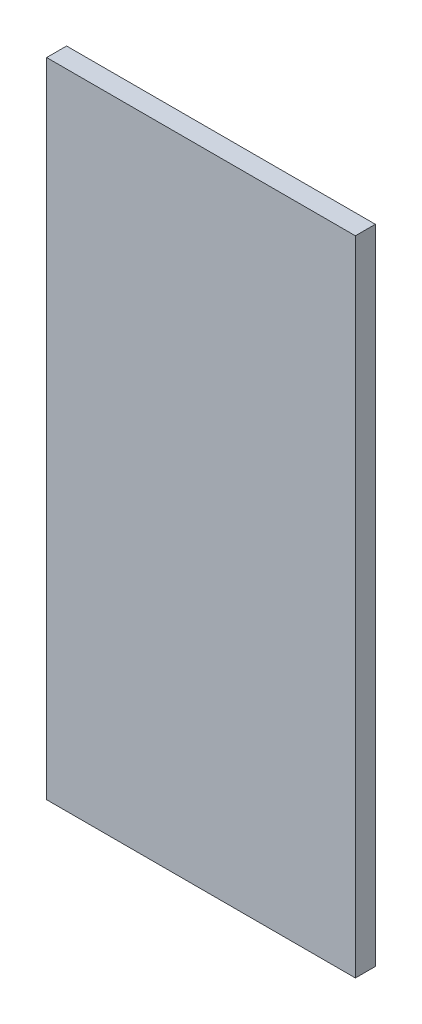
ISO-10303-21;
HEADER;
FILE_DESCRIPTION(('STEP AP214'),'2;1');
FILE_NAME('part.step','',(''),(''),'','','');
FILE_SCHEMA(('AUTOMOTIVE_DESIGN { 1 0 10303 214 1 1 1 1 }'));
ENDSEC;
DATA;
#1=APPLICATION_CONTEXT('core data for automotive mechanical design processes');
#2=APPLICATION_PROTOCOL_DEFINITION('international standard','automotive_design',2000,#1);
#3=PRODUCT_CONTEXT('',#1,'mechanical');
#4=PRODUCT('Part','Part','',(#3));
#5=PRODUCT_RELATED_PRODUCT_CATEGORY('part','',(#4));
#6=PRODUCT_DEFINITION_FORMATION('','',#4);
#7=PRODUCT_DEFINITION_CONTEXT('part definition',#1,'design');
#8=PRODUCT_DEFINITION('design','',#6,#7);
#9=PRODUCT_DEFINITION_SHAPE('','',#8);
#10=(LENGTH_UNIT() NAMED_UNIT(*) SI_UNIT(.MILLI.,.METRE.));
#11=(NAMED_UNIT(*) PLANE_ANGLE_UNIT() SI_UNIT($,.RADIAN.));
#12=(NAMED_UNIT(*) SI_UNIT($,.STERADIAN.) SOLID_ANGLE_UNIT());
#13=UNCERTAINTY_MEASURE_WITH_UNIT(LENGTH_MEASURE(1.E-05),#10,'distance_accuracy_value','');
#14=(GEOMETRIC_REPRESENTATION_CONTEXT(3) GLOBAL_UNCERTAINTY_ASSIGNED_CONTEXT((#13)) GLOBAL_UNIT_ASSIGNED_CONTEXT((#10,
#11,#12)) REPRESENTATION_CONTEXT('',''));
#15=CARTESIAN_POINT('',(0.,0.,0.));
#16=DIRECTION('',(0.,0.,1.));
#17=DIRECTION('',(1.,0.,0.));
#18=AXIS2_PLACEMENT_3D('',#15,#16,#17);
#19=CARTESIAN_POINT('',(87.8420028686523,102.857002258301,0.));
#20=DIRECTION('',(1.,0.,0.));
#21=DIRECTION('',(0.,-1.,0.));
#22=AXIS2_PLACEMENT_3D('',#19,#20,#21);
#23=PLANE('',#22);
#24=DIRECTION('',(0.,-1.,0.));
#25=VECTOR('',#24,1.);
#26=CARTESIAN_POINT('',(87.8420028686523,102.857002258301,0.03556));
#27=LINE('',#26,#25);
#28=CARTESIAN_POINT('',(87.8420028686523,102.857002258301,0.03556));
#29=VERTEX_POINT('',#28);
#30=CARTESIAN_POINT('',(87.8420028686523,101.71199798584,0.03556));
#31=VERTEX_POINT('',#30);
#32=EDGE_CURVE('E11',#29,#31,#27,.T.);
#33=ORIENTED_EDGE('',*,*,#32,.F.);
#34=DIRECTION('',(0.,0.,1.));
#35=VECTOR('',#34,1.);
#36=CARTESIAN_POINT('',(87.8420028686523,102.857002258301,0.));
#37=LINE('',#36,#35);
#38=CARTESIAN_POINT('',(87.8420028686523,102.857002258301,0.));
#39=VERTEX_POINT('',#38);
#40=EDGE_CURVE('E24',#39,#29,#37,.T.);
#41=ORIENTED_EDGE('',*,*,#40,.F.);
#42=DIRECTION('',(0.,-1.,0.));
#43=VECTOR('',#42,1.);
#44=CARTESIAN_POINT('',(87.8420028686523,102.857002258301,0.));
#45=LINE('',#44,#43);
#46=CARTESIAN_POINT('',(87.8420028686523,101.71199798584,0.));
#47=VERTEX_POINT('',#46);
#48=EDGE_CURVE('E75',#39,#47,#45,.T.);
#49=ORIENTED_EDGE('',*,*,#48,.T.);
#50=DIRECTION('',(0.,0.,1.));
#51=VECTOR('',#50,1.);
#52=CARTESIAN_POINT('',(87.8420028686523,101.71199798584,0.));
#53=LINE('',#52,#51);
#54=EDGE_CURVE('E37',#47,#31,#53,.T.);
#55=ORIENTED_EDGE('',*,*,#54,.T.);
#56=EDGE_LOOP('',(#33,#41,#49,#55));
#57=FACE_BOUND('',#56,.T.);
#58=ADVANCED_FACE('F17',(#57),#23,.F.);
#59=CARTESIAN_POINT('',(87.8420028686523,101.71199798584,0.));
#60=DIRECTION('',(0.,1.,0.));
#61=DIRECTION('',(1.,0.,0.));
#62=AXIS2_PLACEMENT_3D('',#59,#60,#61);
#63=PLANE('',#62);
#64=DIRECTION('',(1.,0.,0.));
#65=VECTOR('',#64,1.);
#66=CARTESIAN_POINT('',(87.8420028686523,101.71199798584,0.03556));
#67=LINE('',#66,#65);
#68=CARTESIAN_POINT('',(88.3919982910156,101.71199798584,0.03556));
#69=VERTEX_POINT('',#68);
#70=EDGE_CURVE('E83',#31,#69,#67,.T.);
#71=ORIENTED_EDGE('',*,*,#70,.F.);
#72=ORIENTED_EDGE('',*,*,#54,.F.);
#73=DIRECTION('',(1.,0.,0.));
#74=VECTOR('',#73,1.);
#75=CARTESIAN_POINT('',(87.8420028686523,101.71199798584,0.));
#76=LINE('',#75,#74);
#77=CARTESIAN_POINT('',(88.3919982910156,101.71199798584,0.));
#78=VERTEX_POINT('',#77);
#79=EDGE_CURVE('E81',#47,#78,#76,.T.);
#80=ORIENTED_EDGE('',*,*,#79,.T.);
#81=DIRECTION('',(0.,0.,1.));
#82=VECTOR('',#81,1.);
#83=CARTESIAN_POINT('',(88.3919982910156,101.71199798584,0.));
#84=LINE('',#83,#82);
#85=EDGE_CURVE('E67',#78,#69,#84,.T.);
#86=ORIENTED_EDGE('',*,*,#85,.T.);
#87=EDGE_LOOP('',(#71,#72,#80,#86));
#88=FACE_BOUND('',#87,.T.);
#89=ADVANCED_FACE('F89',(#88),#63,.F.);
#90=CARTESIAN_POINT('',(88.3919982910156,101.71199798584,0.));
#91=DIRECTION('',(-1.,0.,0.));
#92=DIRECTION('',(0.,1.,0.));
#93=AXIS2_PLACEMENT_3D('',#90,#91,#92);
#94=PLANE('',#93);
#95=DIRECTION('',(0.,1.,0.));
#96=VECTOR('',#95,1.);
#97=CARTESIAN_POINT('',(88.3919982910156,101.71199798584,0.03556));
#98=LINE('',#97,#96);
#99=CARTESIAN_POINT('',(88.3919982910156,102.857002258301,0.03556));
#100=VERTEX_POINT('',#99);
#101=EDGE_CURVE('E71',#69,#100,#98,.T.);
#102=ORIENTED_EDGE('',*,*,#101,.F.);
#103=ORIENTED_EDGE('',*,*,#85,.F.);
#104=DIRECTION('',(0.,1.,0.));
#105=VECTOR('',#104,1.);
#106=CARTESIAN_POINT('',(88.3919982910156,101.71199798584,0.));
#107=LINE('',#106,#105);
#108=CARTESIAN_POINT('',(88.3919982910156,102.857002258301,0.));
#109=VERTEX_POINT('',#108);
#110=EDGE_CURVE('E63',#78,#109,#107,.T.);
#111=ORIENTED_EDGE('',*,*,#110,.T.);
#112=DIRECTION('',(0.,0.,1.));
#113=VECTOR('',#112,1.);
#114=CARTESIAN_POINT('',(88.3919982910156,102.857002258301,0.));
#115=LINE('',#114,#113);
#116=EDGE_CURVE('E53',#109,#100,#115,.T.);
#117=ORIENTED_EDGE('',*,*,#116,.T.);
#118=EDGE_LOOP('',(#102,#103,#111,#117));
#119=FACE_BOUND('',#118,.T.);
#120=ADVANCED_FACE('F66',(#119),#94,.F.);
#121=CARTESIAN_POINT('',(88.3919982910156,102.857002258301,0.));
#122=DIRECTION('',(0.,-1.,0.));
#123=DIRECTION('',(-1.,0.,0.));
#124=AXIS2_PLACEMENT_3D('',#121,#122,#123);
#125=PLANE('',#124);
#126=DIRECTION('',(-1.,0.,0.));
#127=VECTOR('',#126,1.);
#128=CARTESIAN_POINT('',(88.3919982910156,102.857002258301,0.03556));
#129=LINE('',#128,#127);
#130=EDGE_CURVE('E59',#100,#29,#129,.T.);
#131=ORIENTED_EDGE('',*,*,#130,.F.);
#132=ORIENTED_EDGE('',*,*,#116,.F.);
#133=DIRECTION('',(-1.,0.,0.));
#134=VECTOR('',#133,1.);
#135=CARTESIAN_POINT('',(88.3919982910156,102.857002258301,0.));
#136=LINE('',#135,#134);
#137=EDGE_CURVE('E57',#109,#39,#136,.T.);
#138=ORIENTED_EDGE('',*,*,#137,.T.);
#139=ORIENTED_EDGE('',*,*,#40,.T.);
#140=EDGE_LOOP('',(#131,#132,#138,#139));
#141=FACE_BOUND('',#140,.T.);
#142=ADVANCED_FACE('F55',(#141),#125,.F.);
#143=CARTESIAN_POINT('',(87.8420028686523,102.857002258301,0.));
#144=DIRECTION('',(0.,0.,-1.));
#145=DIRECTION('',(-1.,0.,0.));
#146=AXIS2_PLACEMENT_3D('',#143,#144,#145);
#147=PLANE('',#146);
#148=ORIENTED_EDGE('',*,*,#137,.F.);
#149=ORIENTED_EDGE('',*,*,#110,.F.);
#150=ORIENTED_EDGE('',*,*,#79,.F.);
#151=ORIENTED_EDGE('',*,*,#48,.F.);
#152=EDGE_LOOP('',(#148,#149,#150,#151));
#153=FACE_BOUND('',#152,.T.);
#154=ADVANCED_FACE('F74',(#153),#147,.T.);
#155=CARTESIAN_POINT('',(87.8420028686523,102.857002258301,0.03556));
#156=DIRECTION('',(0.,0.,-1.));
#157=DIRECTION('',(-1.,0.,0.));
#158=AXIS2_PLACEMENT_3D('',#155,#156,#157);
#159=PLANE('',#158);
#160=ORIENTED_EDGE('',*,*,#32,.T.);
#161=ORIENTED_EDGE('',*,*,#70,.T.);
#162=ORIENTED_EDGE('',*,*,#101,.T.);
#163=ORIENTED_EDGE('',*,*,#130,.T.);
#164=EDGE_LOOP('',(#160,#161,#162,#163));
#165=FACE_BOUND('',#164,.T.);
#166=ADVANCED_FACE('F91',(#165),#159,.F.);
#167=CLOSED_SHELL('',(#58,#89,#120,#142,#154,#166));
#168=MANIFOLD_SOLID_BREP('B1',#167);
#169=ADVANCED_BREP_SHAPE_REPRESENTATION('',(#18,#168),#14);
#170=SHAPE_DEFINITION_REPRESENTATION(#9,#169);
ENDSEC;
END-ISO-10303-21;
